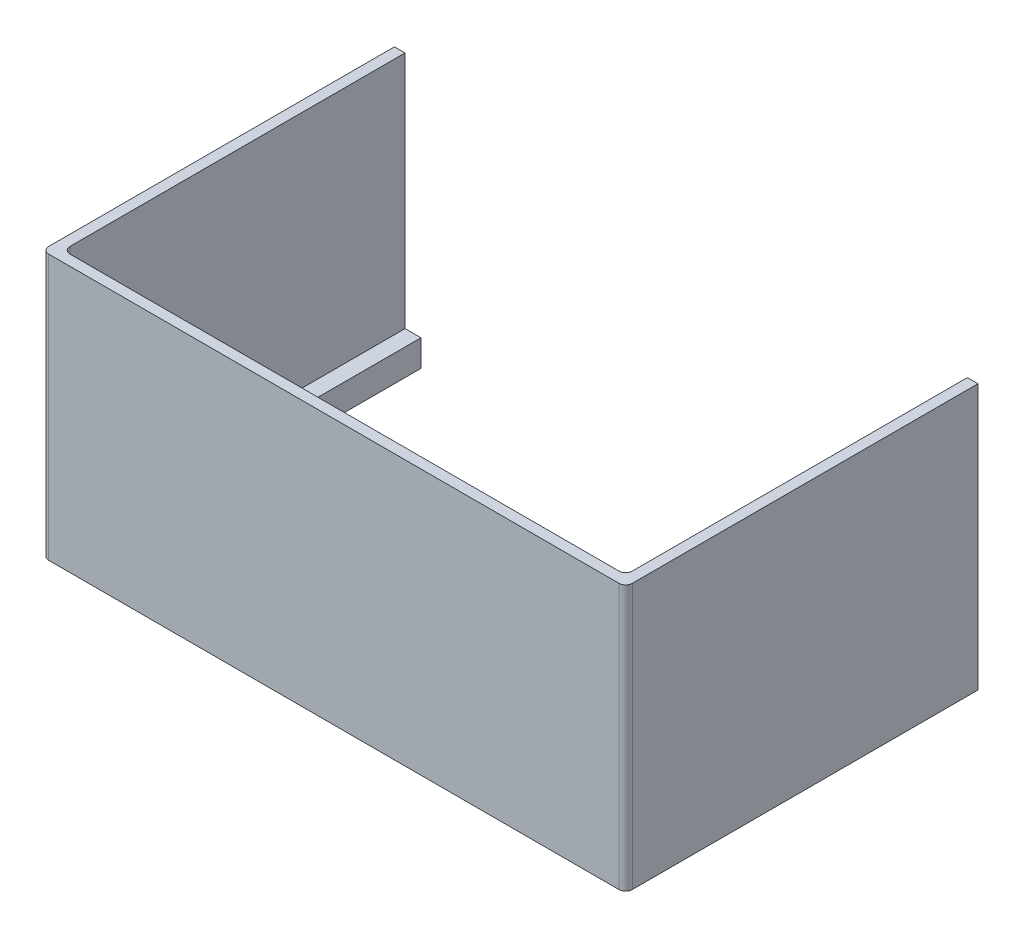
ISO-10303-21;
HEADER;
FILE_DESCRIPTION(('STEP AP214'),'2;1');
FILE_NAME('part.step','',(''),(''),'','','');
FILE_SCHEMA(('AUTOMOTIVE_DESIGN { 1 0 10303 214 1 1 1 1 }'));
ENDSEC;
DATA;
#1=APPLICATION_CONTEXT('core data for automotive mechanical design processes');
#2=APPLICATION_PROTOCOL_DEFINITION('international standard','automotive_design',2000,#1);
#3=PRODUCT_CONTEXT('',#1,'mechanical');
#4=PRODUCT('Part','Part','',(#3));
#5=PRODUCT_RELATED_PRODUCT_CATEGORY('part','',(#4));
#6=PRODUCT_DEFINITION_FORMATION('','',#4);
#7=PRODUCT_DEFINITION_CONTEXT('part definition',#1,'design');
#8=PRODUCT_DEFINITION('design','',#6,#7);
#9=PRODUCT_DEFINITION_SHAPE('','',#8);
#10=(LENGTH_UNIT() NAMED_UNIT(*) SI_UNIT(.MILLI.,.METRE.));
#11=(NAMED_UNIT(*) PLANE_ANGLE_UNIT() SI_UNIT($,.RADIAN.));
#12=(NAMED_UNIT(*) SI_UNIT($,.STERADIAN.) SOLID_ANGLE_UNIT());
#13=UNCERTAINTY_MEASURE_WITH_UNIT(LENGTH_MEASURE(1.E-05),#10,'distance_accuracy_value','');
#14=(GEOMETRIC_REPRESENTATION_CONTEXT(3) GLOBAL_UNCERTAINTY_ASSIGNED_CONTEXT((#13)) GLOBAL_UNIT_ASSIGNED_CONTEXT((#10,
#11,#12)) REPRESENTATION_CONTEXT('',''));
#15=CARTESIAN_POINT('',(0.,0.,0.));
#16=DIRECTION('',(0.,0.,1.));
#17=DIRECTION('',(1.,0.,0.));
#18=AXIS2_PLACEMENT_3D('',#15,#16,#17);
#19=CARTESIAN_POINT('',(-69.85,0.,-7.25424000000001));
#20=DIRECTION('',(0.,0.,1.));
#21=DIRECTION('',(1.,0.,0.));
#22=AXIS2_PLACEMENT_3D('',#19,#20,#21);
#23=PLANE('',#22);
#24=DIRECTION('',(1.,0.,0.));
#25=VECTOR('',#24,1.);
#26=CARTESIAN_POINT('',(-69.85,0.,-7.25424000000001));
#27=LINE('',#26,#25);
#28=CARTESIAN_POINT('',(-69.85,0.,-7.25424000000001));
#29=VERTEX_POINT('',#28);
#30=CARTESIAN_POINT('',(-63.5000000000001,0.,-7.25424000000001));
#31=VERTEX_POINT('',#30);
#32=EDGE_CURVE('E268',#29,#31,#27,.T.);
#33=ORIENTED_EDGE('',*,*,#32,.F.);
#34=DIRECTION('',(0.,1.,0.));
#35=VECTOR('',#34,1.);
#36=CARTESIAN_POINT('',(-69.85,0.,-7.25424000000001));
#37=LINE('',#36,#35);
#38=CARTESIAN_POINT('',(-69.85,63.5,-7.25424000000001));
#39=VERTEX_POINT('',#38);
#40=EDGE_CURVE('E271',#29,#39,#37,.T.);
#41=ORIENTED_EDGE('',*,*,#40,.T.);
#42=DIRECTION('',(1.,0.,0.));
#43=VECTOR('',#42,1.);
#44=CARTESIAN_POINT('',(-69.85,63.5,-7.25424000000001));
#45=LINE('',#44,#43);
#46=CARTESIAN_POINT('',(-67.31,63.5,-7.25424000000001));
#47=VERTEX_POINT('',#46);
#48=EDGE_CURVE('E273',#39,#47,#45,.T.);
#49=ORIENTED_EDGE('',*,*,#48,.T.);
#50=DIRECTION('',(0.,-1.,0.));
#51=VECTOR('',#50,1.);
#52=CARTESIAN_POINT('',(-67.31,63.5,-7.25424000000001));
#53=LINE('',#52,#51);
#54=CARTESIAN_POINT('',(-67.31,6.35,-7.25424000000001));
#55=VERTEX_POINT('',#54);
#56=EDGE_CURVE('E343',#47,#55,#53,.T.);
#57=ORIENTED_EDGE('',*,*,#56,.T.);
#58=DIRECTION('',(-1.,0.,0.));
#59=VECTOR('',#58,1.);
#60=CARTESIAN_POINT('',(0.,6.35,-7.25424000000001));
#61=LINE('',#60,#59);
#62=CARTESIAN_POINT('',(-63.5000000000001,6.35,-7.25424000000001));
#63=VERTEX_POINT('',#62);
#64=EDGE_CURVE('E278',#63,#55,#61,.T.);
#65=ORIENTED_EDGE('',*,*,#64,.F.);
#66=DIRECTION('',(0.,1.,0.));
#67=VECTOR('',#66,1.);
#68=CARTESIAN_POINT('',(-63.5000000000001,0.,-7.25424000000001));
#69=LINE('',#68,#67);
#70=EDGE_CURVE('E282',#31,#63,#69,.T.);
#71=ORIENTED_EDGE('',*,*,#70,.F.);
#72=EDGE_LOOP('',(#33,#41,#49,#57,#65,#71));
#73=FACE_BOUND('',#72,.T.);
#74=DIRECTION('',(0.,-1.,0.));
#75=VECTOR('',#74,1.);
#76=CARTESIAN_POINT('',(-67.437,0.,-7.25424000000001));
#77=LINE('',#76,#75);
#78=CARTESIAN_POINT('',(-67.437,4.8895,-7.25424000000001));
#79=VERTEX_POINT('',#78);
#80=CARTESIAN_POINT('',(-67.437,1.4605,-7.25424000000001));
#81=VERTEX_POINT('',#80);
#82=EDGE_CURVE('E221',#79,#81,#77,.T.);
#83=ORIENTED_EDGE('',*,*,#82,.T.);
#84=DIRECTION('',(1.,0.,0.));
#85=VECTOR('',#84,1.);
#86=CARTESIAN_POINT('',(0.,1.4605,-7.25424000000001));
#87=LINE('',#86,#85);
#88=CARTESIAN_POINT('',(-64.9605000000001,1.4605,-7.25424000000001));
#89=VERTEX_POINT('',#88);
#90=EDGE_CURVE('E242',#81,#89,#87,.T.);
#91=ORIENTED_EDGE('',*,*,#90,.T.);
#92=DIRECTION('',(0.,-1.,0.));
#93=VECTOR('',#92,1.);
#94=CARTESIAN_POINT('',(-64.9605000000001,0.,-7.25424000000001));
#95=LINE('',#94,#93);
#96=CARTESIAN_POINT('',(-64.9605000000001,4.8895,-7.25424000000001));
#97=VERTEX_POINT('',#96);
#98=EDGE_CURVE('E253',#97,#89,#95,.T.);
#99=ORIENTED_EDGE('',*,*,#98,.F.);
#100=DIRECTION('',(1.,0.,0.));
#101=VECTOR('',#100,1.);
#102=CARTESIAN_POINT('',(0.,4.8895,-7.25424000000001));
#103=LINE('',#102,#101);
#104=EDGE_CURVE('E224',#79,#97,#103,.T.);
#105=ORIENTED_EDGE('',*,*,#104,.F.);
#106=EDGE_LOOP('',(#83,#91,#99,#105));
#107=FACE_BOUND('',#106,.T.);
#108=ADVANCED_FACE('F34',(#73,#107),#23,.F.);
#109=CARTESIAN_POINT('',(69.85,6.35,77.10424));
#110=DIRECTION('',(-1.,0.,0.));
#111=DIRECTION('',(0.,0.,1.));
#112=AXIS2_PLACEMENT_3D('',#109,#110,#111);
#113=PLANE('',#112);
#114=DIRECTION('',(0.,0.,-1.));
#115=VECTOR('',#114,1.);
#116=CARTESIAN_POINT('',(69.85,63.5,-77.10424));
#117=LINE('',#116,#115);
#118=CARTESIAN_POINT('',(69.85,63.5,75.51674));
#119=VERTEX_POINT('',#118);
#120=CARTESIAN_POINT('',(69.85,63.5,-7.25424000000001));
#121=VERTEX_POINT('',#120);
#122=EDGE_CURVE('E302',#119,#121,#117,.T.);
#123=ORIENTED_EDGE('',*,*,#122,.F.);
#124=DIRECTION('',(0.,-1.,0.));
#125=VECTOR('',#124,1.);
#126=CARTESIAN_POINT('',(69.85,6.35,75.51674));
#127=LINE('',#126,#125);
#128=CARTESIAN_POINT('',(69.85,0.,75.51674));
#129=VERTEX_POINT('',#128);
#130=EDGE_CURVE('E345',#119,#129,#127,.T.);
#131=ORIENTED_EDGE('',*,*,#130,.T.);
#132=DIRECTION('',(0.,0.,-1.));
#133=VECTOR('',#132,1.);
#134=CARTESIAN_POINT('',(69.85,0.,77.10424));
#135=LINE('',#134,#133);
#136=CARTESIAN_POINT('',(69.85,0.,-7.25424000000001));
#137=VERTEX_POINT('',#136);
#138=EDGE_CURVE('E333',#129,#137,#135,.T.);
#139=ORIENTED_EDGE('',*,*,#138,.T.);
#140=DIRECTION('',(0.,1.,0.));
#141=VECTOR('',#140,1.);
#142=CARTESIAN_POINT('',(69.85,0.,-7.25424000000001));
#143=LINE('',#142,#141);
#144=EDGE_CURVE('E275',#137,#121,#143,.T.);
#145=ORIENTED_EDGE('',*,*,#144,.T.);
#146=EDGE_LOOP('',(#123,#131,#139,#145));
#147=FACE_BOUND('',#146,.T.);
#148=ADVANCED_FACE('F440',(#147),#113,.F.);
#149=CARTESIAN_POINT('',(-69.85,6.35,77.10424));
#150=DIRECTION('',(1.,0.,0.));
#151=DIRECTION('',(0.,0.,-1.));
#152=AXIS2_PLACEMENT_3D('',#149,#150,#151);
#153=PLANE('',#152);
#154=DIRECTION('',(0.,0.,1.));
#155=VECTOR('',#154,1.);
#156=CARTESIAN_POINT('',(-69.85,0.,77.10424));
#157=LINE('',#156,#155);
#158=CARTESIAN_POINT('',(-69.85,0.,75.51674));
#159=VERTEX_POINT('',#158);
#160=EDGE_CURVE('E337',#29,#159,#157,.T.);
#161=ORIENTED_EDGE('',*,*,#160,.T.);
#162=DIRECTION('',(0.,-1.,0.));
#163=VECTOR('',#162,1.);
#164=CARTESIAN_POINT('',(-69.85,6.35,75.51674));
#165=LINE('',#164,#163);
#166=CARTESIAN_POINT('',(-69.85,63.5,75.51674));
#167=VERTEX_POINT('',#166);
#168=EDGE_CURVE('E361',#159,#167,#165,.F.);
#169=ORIENTED_EDGE('',*,*,#168,.T.);
#170=DIRECTION('',(0.,0.,1.));
#171=VECTOR('',#170,1.);
#172=CARTESIAN_POINT('',(-69.85,63.5,-77.10424));
#173=LINE('',#172,#171);
#174=EDGE_CURVE('E308',#39,#167,#173,.T.);
#175=ORIENTED_EDGE('',*,*,#174,.F.);
#176=ORIENTED_EDGE('',*,*,#40,.F.);
#177=EDGE_LOOP('',(#161,#169,#175,#176));
#178=FACE_BOUND('',#177,.T.);
#179=ADVANCED_FACE('F424',(#178),#153,.F.);
#180=CARTESIAN_POINT('',(-69.85,6.35,77.10424));
#181=DIRECTION('',(0.,0.,-1.));
#182=DIRECTION('',(-1.,0.,0.));
#183=AXIS2_PLACEMENT_3D('',#180,#181,#182);
#184=PLANE('',#183);
#185=DIRECTION('',(1.,0.,0.));
#186=VECTOR('',#185,1.);
#187=CARTESIAN_POINT('',(-69.85,0.,77.10424));
#188=LINE('',#187,#186);
#189=CARTESIAN_POINT('',(-68.2624999999999,0.,77.10424));
#190=VERTEX_POINT('',#189);
#191=CARTESIAN_POINT('',(68.2625,0.,77.10424));
#192=VERTEX_POINT('',#191);
#193=EDGE_CURVE('E340',#190,#192,#188,.T.);
#194=ORIENTED_EDGE('',*,*,#193,.T.);
#195=DIRECTION('',(0.,-1.,0.));
#196=VECTOR('',#195,1.);
#197=CARTESIAN_POINT('',(68.2625,6.35,77.10424));
#198=LINE('',#197,#196);
#199=CARTESIAN_POINT('',(68.2625,63.5,77.10424));
#200=VERTEX_POINT('',#199);
#201=EDGE_CURVE('E355',#192,#200,#198,.F.);
#202=ORIENTED_EDGE('',*,*,#201,.T.);
#203=DIRECTION('',(1.,0.,0.));
#204=VECTOR('',#203,1.);
#205=CARTESIAN_POINT('',(-69.85,63.5,77.10424));
#206=LINE('',#205,#204);
#207=CARTESIAN_POINT('',(-68.2624999999999,63.5,77.10424));
#208=VERTEX_POINT('',#207);
#209=EDGE_CURVE('E311',#208,#200,#206,.T.);
#210=ORIENTED_EDGE('',*,*,#209,.F.);
#211=DIRECTION('',(0.,-1.,0.));
#212=VECTOR('',#211,1.);
#213=CARTESIAN_POINT('',(-68.2624999999999,6.35,77.10424));
#214=LINE('',#213,#212);
#215=EDGE_CURVE('E352',#208,#190,#214,.T.);
#216=ORIENTED_EDGE('',*,*,#215,.T.);
#217=EDGE_LOOP('',(#194,#202,#210,#216));
#218=FACE_BOUND('',#217,.T.);
#219=ADVANCED_FACE('F433',(#218),#184,.F.);
#220=CARTESIAN_POINT('',(0.,6.35,0.));
#221=DIRECTION('',(0.,-1.,0.));
#222=DIRECTION('',(0.,0.,-1.));
#223=AXIS2_PLACEMENT_3D('',#220,#221,#222);
#224=PLANE('',#223);
#225=DIRECTION('',(0.,0.,1.));
#226=VECTOR('',#225,1.);
#227=CARTESIAN_POINT('',(-67.31,6.35,-74.56424));
#228=LINE('',#227,#226);
#229=CARTESIAN_POINT('',(-67.31,6.35,72.97674));
#230=VERTEX_POINT('',#229);
#231=EDGE_CURVE('E304',#55,#230,#228,.T.);
#232=ORIENTED_EDGE('',*,*,#231,.T.);
#233=CARTESIAN_POINT('',(-65.7225,6.35,72.97674));
#234=DIRECTION('',(0.,-1.,0.));
#235=DIRECTION('',(0.,0.,-1.));
#236=AXIS2_PLACEMENT_3D('',#233,#234,#235);
#237=CIRCLE('',#236,1.5875);
#238=CARTESIAN_POINT('',(-65.7225,6.35,74.56424));
#239=VERTEX_POINT('',#238);
#240=EDGE_CURVE('E57',#230,#239,#237,.F.);
#241=ORIENTED_EDGE('',*,*,#240,.T.);
#242=DIRECTION('',(1.,0.,0.));
#243=VECTOR('',#242,1.);
#244=CARTESIAN_POINT('',(-67.31,6.35,74.56424));
#245=LINE('',#244,#243);
#246=CARTESIAN_POINT('',(65.7225,6.35,74.56424));
#247=VERTEX_POINT('',#246);
#248=EDGE_CURVE('E296',#239,#247,#245,.T.);
#249=ORIENTED_EDGE('',*,*,#248,.T.);
#250=CARTESIAN_POINT('',(65.7225,6.35,72.97674));
#251=DIRECTION('',(0.,-1.,0.));
#252=DIRECTION('',(0.,0.,-1.));
#253=AXIS2_PLACEMENT_3D('',#250,#251,#252);
#254=CIRCLE('',#253,1.5875);
#255=CARTESIAN_POINT('',(67.31,6.35,72.97674));
#256=VERTEX_POINT('',#255);
#257=EDGE_CURVE('E49',#247,#256,#254,.F.);
#258=ORIENTED_EDGE('',*,*,#257,.T.);
#259=DIRECTION('',(0.,0.,-1.));
#260=VECTOR('',#259,1.);
#261=CARTESIAN_POINT('',(67.31,6.35,-74.56424));
#262=LINE('',#261,#260);
#263=CARTESIAN_POINT('',(67.31,6.35,-7.25424000000001));
#264=VERTEX_POINT('',#263);
#265=EDGE_CURVE('E292',#256,#264,#262,.T.);
#266=ORIENTED_EDGE('',*,*,#265,.T.);
#267=CARTESIAN_POINT('',(63.5,6.35,-7.25424000000001));
#268=VERTEX_POINT('',#267);
#269=EDGE_CURVE('E283',#264,#268,#61,.T.);
#270=ORIENTED_EDGE('',*,*,#269,.T.);
#271=DIRECTION('',(0.,0.,-1.));
#272=VECTOR('',#271,1.);
#273=CARTESIAN_POINT('',(63.5,6.35,70.75424));
#274=LINE('',#273,#272);
#275=CARTESIAN_POINT('',(63.5,6.35,70.75424));
#276=VERTEX_POINT('',#275);
#277=EDGE_CURVE('E314',#276,#268,#274,.T.);
#278=ORIENTED_EDGE('',*,*,#277,.F.);
#279=DIRECTION('',(1.,0.,0.));
#280=VECTOR('',#279,1.);
#281=CARTESIAN_POINT('',(-63.5000000000001,6.35,70.75424));
#282=LINE('',#281,#280);
#283=CARTESIAN_POINT('',(-63.5000000000001,6.35,70.75424));
#284=VERTEX_POINT('',#283);
#285=EDGE_CURVE('E319',#284,#276,#282,.T.);
#286=ORIENTED_EDGE('',*,*,#285,.F.);
#287=DIRECTION('',(0.,0.,1.));
#288=VECTOR('',#287,1.);
#289=CARTESIAN_POINT('',(-63.5000000000001,6.35,70.75424));
#290=LINE('',#289,#288);
#291=EDGE_CURVE('E327',#63,#284,#290,.T.);
#292=ORIENTED_EDGE('',*,*,#291,.F.);
#293=ORIENTED_EDGE('',*,*,#64,.T.);
#294=EDGE_LOOP('',(#232,#241,#249,#258,#266,#270,#278,#286,#292,#293));
#295=FACE_BOUND('',#294,.T.);
#296=ADVANCED_FACE('F389',(#295),#224,.F.);
#297=CARTESIAN_POINT('',(0.,0.,0.));
#298=DIRECTION('',(0.,-1.,0.));
#299=DIRECTION('',(0.,0.,-1.));
#300=AXIS2_PLACEMENT_3D('',#297,#298,#299);
#301=PLANE('',#300);
#302=ORIENTED_EDGE('',*,*,#138,.F.);
#303=CARTESIAN_POINT('',(68.2625,0.,75.51674));
#304=DIRECTION('',(0.,-1.,0.));
#305=DIRECTION('',(0.,0.,-1.));
#306=AXIS2_PLACEMENT_3D('',#303,#304,#305);
#307=CIRCLE('',#306,1.5875);
#308=EDGE_CURVE('E350',#129,#192,#307,.T.);
#309=ORIENTED_EDGE('',*,*,#308,.T.);
#310=ORIENTED_EDGE('',*,*,#193,.F.);
#311=CARTESIAN_POINT('',(-68.2624999999999,0.,75.51674));
#312=DIRECTION('',(0.,-1.,0.));
#313=DIRECTION('',(0.,0.,-1.));
#314=AXIS2_PLACEMENT_3D('',#311,#312,#313);
#315=CIRCLE('',#314,1.5875);
#316=EDGE_CURVE('E348',#190,#159,#315,.T.);
#317=ORIENTED_EDGE('',*,*,#316,.T.);
#318=ORIENTED_EDGE('',*,*,#160,.F.);
#319=ORIENTED_EDGE('',*,*,#32,.T.);
#320=DIRECTION('',(0.,0.,1.));
#321=VECTOR('',#320,1.);
#322=CARTESIAN_POINT('',(-63.5000000000001,0.,70.75424));
#323=LINE('',#322,#321);
#324=CARTESIAN_POINT('',(-63.5000000000001,0.,70.75424));
#325=VERTEX_POINT('',#324);
#326=EDGE_CURVE('E318',#31,#325,#323,.T.);
#327=ORIENTED_EDGE('',*,*,#326,.T.);
#328=DIRECTION('',(1.,0.,0.));
#329=VECTOR('',#328,1.);
#330=CARTESIAN_POINT('',(-63.5000000000001,0.,70.75424));
#331=LINE('',#330,#329);
#332=CARTESIAN_POINT('',(63.5,0.,70.75424));
#333=VERTEX_POINT('',#332);
#334=EDGE_CURVE('E321',#325,#333,#331,.T.);
#335=ORIENTED_EDGE('',*,*,#334,.T.);
#336=DIRECTION('',(0.,0.,-1.));
#337=VECTOR('',#336,1.);
#338=CARTESIAN_POINT('',(63.5,0.,70.75424));
#339=LINE('',#338,#337);
#340=CARTESIAN_POINT('',(63.5,0.,-7.25424000000001));
#341=VERTEX_POINT('',#340);
#342=EDGE_CURVE('E315',#333,#341,#339,.T.);
#343=ORIENTED_EDGE('',*,*,#342,.T.);
#344=EDGE_CURVE('E272',#341,#137,#27,.T.);
#345=ORIENTED_EDGE('',*,*,#344,.T.);
#346=EDGE_LOOP('',(#302,#309,#310,#317,#318,#319,#327,#335,#343,#345));
#347=FACE_BOUND('',#346,.T.);
#348=ADVANCED_FACE('F420',(#347),#301,.T.);
#349=CARTESIAN_POINT('',(63.5,0.,70.75424));
#350=DIRECTION('',(1.,0.,0.));
#351=DIRECTION('',(0.,0.,-1.));
#352=AXIS2_PLACEMENT_3D('',#349,#350,#351);
#353=PLANE('',#352);
#354=ORIENTED_EDGE('',*,*,#277,.T.);
#355=DIRECTION('',(0.,-1.,0.));
#356=VECTOR('',#355,1.);
#357=CARTESIAN_POINT('',(63.5,0.,-7.25424000000001));
#358=LINE('',#357,#356);
#359=EDGE_CURVE('E289',#268,#341,#358,.T.);
#360=ORIENTED_EDGE('',*,*,#359,.T.);
#361=ORIENTED_EDGE('',*,*,#342,.F.);
#362=DIRECTION('',(0.,1.,0.));
#363=VECTOR('',#362,1.);
#364=CARTESIAN_POINT('',(63.5,0.,70.75424));
#365=LINE('',#364,#363);
#366=EDGE_CURVE('E331',#333,#276,#365,.T.);
#367=ORIENTED_EDGE('',*,*,#366,.T.);
#368=EDGE_LOOP('',(#354,#360,#361,#367));
#369=FACE_BOUND('',#368,.T.);
#370=ADVANCED_FACE('F404',(#369),#353,.F.);
#371=CARTESIAN_POINT('',(-63.5000000000001,0.,70.75424));
#372=DIRECTION('',(0.,0.,1.));
#373=DIRECTION('',(1.,0.,0.));
#374=AXIS2_PLACEMENT_3D('',#371,#372,#373);
#375=PLANE('',#374);
#376=ORIENTED_EDGE('',*,*,#285,.T.);
#377=ORIENTED_EDGE('',*,*,#366,.F.);
#378=ORIENTED_EDGE('',*,*,#334,.F.);
#379=DIRECTION('',(0.,1.,0.));
#380=VECTOR('',#379,1.);
#381=CARTESIAN_POINT('',(-63.5000000000001,0.,70.75424));
#382=LINE('',#381,#380);
#383=EDGE_CURVE('E324',#325,#284,#382,.T.);
#384=ORIENTED_EDGE('',*,*,#383,.T.);
#385=EDGE_LOOP('',(#376,#377,#378,#384));
#386=FACE_BOUND('',#385,.T.);
#387=ADVANCED_FACE('F408',(#386),#375,.F.);
#388=CARTESIAN_POINT('',(-63.5000000000001,0.,70.75424));
#389=DIRECTION('',(-1.,0.,0.));
#390=DIRECTION('',(0.,0.,1.));
#391=AXIS2_PLACEMENT_3D('',#388,#389,#390);
#392=PLANE('',#391);
#393=ORIENTED_EDGE('',*,*,#326,.F.);
#394=ORIENTED_EDGE('',*,*,#70,.T.);
#395=ORIENTED_EDGE('',*,*,#291,.T.);
#396=ORIENTED_EDGE('',*,*,#383,.F.);
#397=EDGE_LOOP('',(#393,#394,#395,#396));
#398=FACE_BOUND('',#397,.T.);
#399=ADVANCED_FACE('F413',(#398),#392,.F.);
#400=CARTESIAN_POINT('',(0.,63.5,0.));
#401=DIRECTION('',(0.,1.,0.));
#402=DIRECTION('',(0.,0.,1.));
#403=AXIS2_PLACEMENT_3D('',#400,#401,#402);
#404=PLANE('',#403);
#405=ORIENTED_EDGE('',*,*,#209,.T.);
#406=CARTESIAN_POINT('',(68.2625,63.5,75.51674));
#407=DIRECTION('',(0.,1.,0.));
#408=DIRECTION('',(0.,0.,1.));
#409=AXIS2_PLACEMENT_3D('',#406,#407,#408);
#410=CIRCLE('',#409,1.5875);
#411=EDGE_CURVE('E359',#200,#119,#410,.T.);
#412=ORIENTED_EDGE('',*,*,#411,.T.);
#413=ORIENTED_EDGE('',*,*,#122,.T.);
#414=CARTESIAN_POINT('',(67.31,63.5,-7.25424000000001));
#415=VERTEX_POINT('',#414);
#416=EDGE_CURVE('E261',#415,#121,#45,.T.);
#417=ORIENTED_EDGE('',*,*,#416,.F.);
#418=DIRECTION('',(0.,0.,-1.));
#419=VECTOR('',#418,1.);
#420=CARTESIAN_POINT('',(67.31,63.5,-74.56424));
#421=LINE('',#420,#419);
#422=CARTESIAN_POINT('',(67.31,63.5,72.97674));
#423=VERTEX_POINT('',#422);
#424=EDGE_CURVE('E293',#423,#415,#421,.T.);
#425=ORIENTED_EDGE('',*,*,#424,.F.);
#426=CARTESIAN_POINT('',(65.7225,63.5,72.97674));
#427=DIRECTION('',(0.,1.,0.));
#428=DIRECTION('',(0.,0.,1.));
#429=AXIS2_PLACEMENT_3D('',#426,#427,#428);
#430=CIRCLE('',#429,1.5875);
#431=CARTESIAN_POINT('',(65.7225,63.5,74.56424));
#432=VERTEX_POINT('',#431);
#433=EDGE_CURVE('E11',#423,#432,#430,.F.);
#434=ORIENTED_EDGE('',*,*,#433,.T.);
#435=DIRECTION('',(1.,0.,0.));
#436=VECTOR('',#435,1.);
#437=CARTESIAN_POINT('',(-67.31,63.5,74.56424));
#438=LINE('',#437,#436);
#439=CARTESIAN_POINT('',(-65.7225,63.5,74.56424));
#440=VERTEX_POINT('',#439);
#441=EDGE_CURVE('E299',#440,#432,#438,.T.);
#442=ORIENTED_EDGE('',*,*,#441,.F.);
#443=CARTESIAN_POINT('',(-65.7225,63.5,72.97674));
#444=DIRECTION('',(0.,1.,0.));
#445=DIRECTION('',(0.,0.,1.));
#446=AXIS2_PLACEMENT_3D('',#443,#444,#445);
#447=CIRCLE('',#446,1.5875);
#448=CARTESIAN_POINT('',(-67.31,63.5,72.97674));
#449=VERTEX_POINT('',#448);
#450=EDGE_CURVE('E42',#440,#449,#447,.F.);
#451=ORIENTED_EDGE('',*,*,#450,.T.);
#452=DIRECTION('',(0.,0.,1.));
#453=VECTOR('',#452,1.);
#454=CARTESIAN_POINT('',(-67.31,63.5,-74.56424));
#455=LINE('',#454,#453);
#456=EDGE_CURVE('E295',#47,#449,#455,.T.);
#457=ORIENTED_EDGE('',*,*,#456,.F.);
#458=ORIENTED_EDGE('',*,*,#48,.F.);
#459=ORIENTED_EDGE('',*,*,#174,.T.);
#460=CARTESIAN_POINT('',(-68.2624999999999,63.5,75.51674));
#461=DIRECTION('',(0.,1.,0.));
#462=DIRECTION('',(0.,0.,1.));
#463=AXIS2_PLACEMENT_3D('',#460,#461,#462);
#464=CIRCLE('',#463,1.5875);
#465=EDGE_CURVE('E357',#167,#208,#464,.T.);
#466=ORIENTED_EDGE('',*,*,#465,.T.);
#467=EDGE_LOOP('',(#405,#412,#413,#417,#425,#434,#442,#451,#457,#458,#459,#466));
#468=FACE_BOUND('',#467,.T.);
#469=ADVANCED_FACE('F377',(#468),#404,.T.);
#470=CARTESIAN_POINT('',(67.31,63.5,-74.56424));
#471=DIRECTION('',(-1.,0.,0.));
#472=DIRECTION('',(0.,0.,1.));
#473=AXIS2_PLACEMENT_3D('',#470,#471,#472);
#474=PLANE('',#473);
#475=ORIENTED_EDGE('',*,*,#265,.F.);
#476=DIRECTION('',(0.,-1.,0.));
#477=VECTOR('',#476,1.);
#478=CARTESIAN_POINT('',(67.31,63.5,72.97674));
#479=LINE('',#478,#477);
#480=EDGE_CURVE('E372',#256,#423,#479,.F.);
#481=ORIENTED_EDGE('',*,*,#480,.T.);
#482=ORIENTED_EDGE('',*,*,#424,.T.);
#483=DIRECTION('',(0.,1.,0.));
#484=VECTOR('',#483,1.);
#485=CARTESIAN_POINT('',(67.31,63.5,-7.25424000000001));
#486=LINE('',#485,#484);
#487=EDGE_CURVE('E286',#264,#415,#486,.T.);
#488=ORIENTED_EDGE('',*,*,#487,.F.);
#489=EDGE_LOOP('',(#475,#481,#482,#488));
#490=FACE_BOUND('',#489,.T.);
#491=ADVANCED_FACE('F395',(#490),#474,.T.);
#492=CARTESIAN_POINT('',(-67.31,63.5,-74.56424));
#493=DIRECTION('',(1.,0.,0.));
#494=DIRECTION('',(0.,0.,-1.));
#495=AXIS2_PLACEMENT_3D('',#492,#493,#494);
#496=PLANE('',#495);
#497=ORIENTED_EDGE('',*,*,#456,.T.);
#498=DIRECTION('',(0.,-1.,0.));
#499=VECTOR('',#498,1.);
#500=CARTESIAN_POINT('',(-67.31,6.35,72.97674));
#501=LINE('',#500,#499);
#502=EDGE_CURVE('E363',#449,#230,#501,.T.);
#503=ORIENTED_EDGE('',*,*,#502,.T.);
#504=ORIENTED_EDGE('',*,*,#231,.F.);
#505=ORIENTED_EDGE('',*,*,#56,.F.);
#506=EDGE_LOOP('',(#497,#503,#504,#505));
#507=FACE_BOUND('',#506,.T.);
#508=ADVANCED_FACE('F384',(#507),#496,.T.);
#509=CARTESIAN_POINT('',(-67.31,63.5,74.56424));
#510=DIRECTION('',(0.,0.,-1.));
#511=DIRECTION('',(-1.,0.,0.));
#512=AXIS2_PLACEMENT_3D('',#509,#510,#511);
#513=PLANE('',#512);
#514=ORIENTED_EDGE('',*,*,#248,.F.);
#515=DIRECTION('',(0.,-1.,0.));
#516=VECTOR('',#515,1.);
#517=CARTESIAN_POINT('',(-65.7225,63.5,74.56424));
#518=LINE('',#517,#516);
#519=EDGE_CURVE('E370',#239,#440,#518,.F.);
#520=ORIENTED_EDGE('',*,*,#519,.T.);
#521=ORIENTED_EDGE('',*,*,#441,.T.);
#522=DIRECTION('',(0.,-1.,0.));
#523=VECTOR('',#522,1.);
#524=CARTESIAN_POINT('',(65.7225,6.35,74.56424));
#525=LINE('',#524,#523);
#526=EDGE_CURVE('E368',#432,#247,#525,.T.);
#527=ORIENTED_EDGE('',*,*,#526,.T.);
#528=EDGE_LOOP('',(#514,#520,#521,#527));
#529=FACE_BOUND('',#528,.T.);
#530=ADVANCED_FACE('F388',(#529),#513,.T.);
#531=DIRECTION('',(-1.,0.,0.));
#532=VECTOR('',#531,1.);
#533=CARTESIAN_POINT('',(67.437,1.4605,-7.25424000000001));
#534=LINE('',#533,#532);
#535=CARTESIAN_POINT('',(67.4370000000001,1.4605,-7.25424000000001));
#536=VERTEX_POINT('',#535);
#537=CARTESIAN_POINT('',(64.9605000000001,1.4605,-7.25424000000001));
#538=VERTEX_POINT('',#537);
#539=EDGE_CURVE('E220',#536,#538,#534,.T.);
#540=ORIENTED_EDGE('',*,*,#539,.F.);
#541=DIRECTION('',(0.,-1.,0.));
#542=VECTOR('',#541,1.);
#543=CARTESIAN_POINT('',(67.437,4.8895,-7.25424000000001));
#544=LINE('',#543,#542);
#545=CARTESIAN_POINT('',(67.437,4.8895,-7.25424000000001));
#546=VERTEX_POINT('',#545);
#547=EDGE_CURVE('E199',#546,#536,#544,.T.);
#548=ORIENTED_EDGE('',*,*,#547,.F.);
#549=DIRECTION('',(-1.,0.,0.));
#550=VECTOR('',#549,1.);
#551=CARTESIAN_POINT('',(67.437,4.8895,-7.25424000000001));
#552=LINE('',#551,#550);
#553=CARTESIAN_POINT('',(64.9605000000001,4.8895,-7.25424000000001));
#554=VERTEX_POINT('',#553);
#555=EDGE_CURVE('E208',#546,#554,#552,.T.);
#556=ORIENTED_EDGE('',*,*,#555,.T.);
#557=DIRECTION('',(0.,-1.,0.));
#558=VECTOR('',#557,1.);
#559=CARTESIAN_POINT('',(64.9605000000001,4.8895,-7.25424000000001));
#560=LINE('',#559,#558);
#561=EDGE_CURVE('E214',#554,#538,#560,.T.);
#562=ORIENTED_EDGE('',*,*,#561,.T.);
#563=EDGE_LOOP('',(#540,#548,#556,#562));
#564=FACE_BOUND('',#563,.T.);
#565=ORIENTED_EDGE('',*,*,#269,.F.);
#566=ORIENTED_EDGE('',*,*,#487,.T.);
#567=ORIENTED_EDGE('',*,*,#416,.T.);
#568=ORIENTED_EDGE('',*,*,#144,.F.);
#569=ORIENTED_EDGE('',*,*,#344,.F.);
#570=ORIENTED_EDGE('',*,*,#359,.F.);
#571=EDGE_LOOP('',(#565,#566,#567,#568,#569,#570));
#572=FACE_BOUND('',#571,.T.);
#573=ADVANCED_FACE('F217',(#564,#572),#23,.F.);
#574=CARTESIAN_POINT('',(-67.437,0.,-3.44424000000001));
#575=DIRECTION('',(1.,0.,0.));
#576=DIRECTION('',(0.,0.,-1.));
#577=AXIS2_PLACEMENT_3D('',#574,#575,#576);
#578=PLANE('',#577);
#579=ORIENTED_EDGE('',*,*,#82,.F.);
#580=DIRECTION('',(0.,0.,-1.));
#581=VECTOR('',#580,1.);
#582=CARTESIAN_POINT('',(-67.437,4.8895,-3.44424000000001));
#583=LINE('',#582,#581);
#584=CARTESIAN_POINT('',(-67.437,4.8895,-3.44424000000001));
#585=VERTEX_POINT('',#584);
#586=EDGE_CURVE('E249',#585,#79,#583,.T.);
#587=ORIENTED_EDGE('',*,*,#586,.F.);
#588=DIRECTION('',(0.,-1.,0.));
#589=VECTOR('',#588,1.);
#590=CARTESIAN_POINT('',(-67.437,0.,-3.44424000000001));
#591=LINE('',#590,#589);
#592=CARTESIAN_POINT('',(-67.437,1.4605,-3.44424000000001));
#593=VERTEX_POINT('',#592);
#594=EDGE_CURVE('E238',#585,#593,#591,.T.);
#595=ORIENTED_EDGE('',*,*,#594,.T.);
#596=DIRECTION('',(0.,0.,-1.));
#597=VECTOR('',#596,1.);
#598=CARTESIAN_POINT('',(-67.437,1.4605,-3.44424000000001));
#599=LINE('',#598,#597);
#600=EDGE_CURVE('E258',#593,#81,#599,.T.);
#601=ORIENTED_EDGE('',*,*,#600,.T.);
#602=EDGE_LOOP('',(#579,#587,#595,#601));
#603=FACE_BOUND('',#602,.T.);
#604=ADVANCED_FACE('F556',(#603),#578,.T.);
#605=CARTESIAN_POINT('',(0.,1.4605,-3.44424000000001));
#606=DIRECTION('',(0.,1.,0.));
#607=DIRECTION('',(0.,0.,1.));
#608=AXIS2_PLACEMENT_3D('',#605,#606,#607);
#609=PLANE('',#608);
#610=ORIENTED_EDGE('',*,*,#90,.F.);
#611=ORIENTED_EDGE('',*,*,#600,.F.);
#612=DIRECTION('',(1.,0.,0.));
#613=VECTOR('',#612,1.);
#614=CARTESIAN_POINT('',(0.,1.4605,-3.44424000000001));
#615=LINE('',#614,#613);
#616=CARTESIAN_POINT('',(-64.9605000000001,1.4605,-3.44424000000001));
#617=VERTEX_POINT('',#616);
#618=EDGE_CURVE('E248',#593,#617,#615,.T.);
#619=ORIENTED_EDGE('',*,*,#618,.T.);
#620=DIRECTION('',(0.,0.,-1.));
#621=VECTOR('',#620,1.);
#622=CARTESIAN_POINT('',(-64.9605000000001,1.4605,-3.44424000000001));
#623=LINE('',#622,#621);
#624=EDGE_CURVE('E262',#617,#89,#623,.T.);
#625=ORIENTED_EDGE('',*,*,#624,.T.);
#626=EDGE_LOOP('',(#610,#611,#619,#625));
#627=FACE_BOUND('',#626,.T.);
#628=ADVANCED_FACE('F563',(#627),#609,.T.);
#629=CARTESIAN_POINT('',(-64.9605000000001,0.,-3.44424000000001));
#630=DIRECTION('',(1.,0.,0.));
#631=DIRECTION('',(0.,0.,-1.));
#632=AXIS2_PLACEMENT_3D('',#629,#630,#631);
#633=PLANE('',#632);
#634=ORIENTED_EDGE('',*,*,#98,.T.);
#635=ORIENTED_EDGE('',*,*,#624,.F.);
#636=DIRECTION('',(0.,-1.,0.));
#637=VECTOR('',#636,1.);
#638=CARTESIAN_POINT('',(-64.9605000000001,0.,-3.44424000000001));
#639=LINE('',#638,#637);
#640=CARTESIAN_POINT('',(-64.9605000000001,4.8895,-3.44424000000001));
#641=VERTEX_POINT('',#640);
#642=EDGE_CURVE('E245',#641,#617,#639,.T.);
#643=ORIENTED_EDGE('',*,*,#642,.F.);
#644=DIRECTION('',(0.,0.,-1.));
#645=VECTOR('',#644,1.);
#646=CARTESIAN_POINT('',(-64.9605000000001,4.8895,-3.44424000000001));
#647=LINE('',#646,#645);
#648=EDGE_CURVE('E264',#641,#97,#647,.T.);
#649=ORIENTED_EDGE('',*,*,#648,.T.);
#650=EDGE_LOOP('',(#634,#635,#643,#649));
#651=FACE_BOUND('',#650,.T.);
#652=ADVANCED_FACE('F573',(#651),#633,.F.);
#653=CARTESIAN_POINT('',(0.,4.8895,-3.44424000000001));
#654=DIRECTION('',(0.,1.,0.));
#655=DIRECTION('',(0.,0.,1.));
#656=AXIS2_PLACEMENT_3D('',#653,#654,#655);
#657=PLANE('',#656);
#658=ORIENTED_EDGE('',*,*,#104,.T.);
#659=ORIENTED_EDGE('',*,*,#648,.F.);
#660=DIRECTION('',(1.,0.,0.));
#661=VECTOR('',#660,1.);
#662=CARTESIAN_POINT('',(0.,4.8895,-3.44424000000001));
#663=LINE('',#662,#661);
#664=EDGE_CURVE('E241',#585,#641,#663,.T.);
#665=ORIENTED_EDGE('',*,*,#664,.F.);
#666=ORIENTED_EDGE('',*,*,#586,.T.);
#667=EDGE_LOOP('',(#658,#659,#665,#666));
#668=FACE_BOUND('',#667,.T.);
#669=ADVANCED_FACE('F583',(#668),#657,.F.);
#670=CARTESIAN_POINT('',(0.,0.,-3.44424000000001));
#671=DIRECTION('',(0.,0.,-1.));
#672=DIRECTION('',(-1.,0.,0.));
#673=AXIS2_PLACEMENT_3D('',#670,#671,#672);
#674=PLANE('',#673);
#675=ORIENTED_EDGE('',*,*,#594,.F.);
#676=ORIENTED_EDGE('',*,*,#664,.T.);
#677=ORIENTED_EDGE('',*,*,#642,.T.);
#678=ORIENTED_EDGE('',*,*,#618,.F.);
#679=EDGE_LOOP('',(#675,#676,#677,#678));
#680=FACE_BOUND('',#679,.T.);
#681=ADVANCED_FACE('F593',(#680),#674,.T.);
#682=CARTESIAN_POINT('',(67.437,4.8895,-3.44424000000001));
#683=DIRECTION('',(1.,0.,0.));
#684=DIRECTION('',(0.,0.,-1.));
#685=AXIS2_PLACEMENT_3D('',#682,#683,#684);
#686=PLANE('',#685);
#687=ORIENTED_EDGE('',*,*,#547,.T.);
#688=DIRECTION('',(0.,0.,-1.));
#689=VECTOR('',#688,1.);
#690=CARTESIAN_POINT('',(67.437,1.4605,-3.44424000000001));
#691=LINE('',#690,#689);
#692=CARTESIAN_POINT('',(67.437,1.4605,-3.44424000000001));
#693=VERTEX_POINT('',#692);
#694=EDGE_CURVE('E232',#693,#536,#691,.T.);
#695=ORIENTED_EDGE('',*,*,#694,.F.);
#696=DIRECTION('',(0.,-1.,0.));
#697=VECTOR('',#696,1.);
#698=CARTESIAN_POINT('',(67.437,4.8895,-3.44424000000001));
#699=LINE('',#698,#697);
#700=CARTESIAN_POINT('',(67.437,4.8895,-3.44424000000001));
#701=VERTEX_POINT('',#700);
#702=EDGE_CURVE('E202',#701,#693,#699,.T.);
#703=ORIENTED_EDGE('',*,*,#702,.F.);
#704=DIRECTION('',(0.,0.,-1.));
#705=VECTOR('',#704,1.);
#706=CARTESIAN_POINT('',(67.437,4.8895,-3.44424000000001));
#707=LINE('',#706,#705);
#708=EDGE_CURVE('E195',#701,#546,#707,.T.);
#709=ORIENTED_EDGE('',*,*,#708,.T.);
#710=EDGE_LOOP('',(#687,#695,#703,#709));
#711=FACE_BOUND('',#710,.T.);
#712=ADVANCED_FACE('F197',(#711),#686,.F.);
#713=CARTESIAN_POINT('',(67.437,4.8895,-3.44424000000001));
#714=DIRECTION('',(0.,-1.,0.));
#715=DIRECTION('',(0.,0.,-1.));
#716=AXIS2_PLACEMENT_3D('',#713,#714,#715);
#717=PLANE('',#716);
#718=ORIENTED_EDGE('',*,*,#555,.F.);
#719=ORIENTED_EDGE('',*,*,#708,.F.);
#720=DIRECTION('',(-1.,0.,0.));
#721=VECTOR('',#720,1.);
#722=CARTESIAN_POINT('',(67.437,4.8895,-3.44424000000001));
#723=LINE('',#722,#721);
#724=CARTESIAN_POINT('',(64.9605000000001,4.8895,-3.44424000000001));
#725=VERTEX_POINT('',#724);
#726=EDGE_CURVE('E229',#701,#725,#723,.T.);
#727=ORIENTED_EDGE('',*,*,#726,.T.);
#728=DIRECTION('',(0.,0.,-1.));
#729=VECTOR('',#728,1.);
#730=CARTESIAN_POINT('',(64.9605000000001,4.8895,-3.44424000000001));
#731=LINE('',#730,#729);
#732=EDGE_CURVE('E205',#725,#554,#731,.T.);
#733=ORIENTED_EDGE('',*,*,#732,.T.);
#734=EDGE_LOOP('',(#718,#719,#727,#733));
#735=FACE_BOUND('',#734,.T.);
#736=ADVANCED_FACE('F209',(#735),#717,.T.);
#737=CARTESIAN_POINT('',(64.9605000000001,4.8895,-3.44424000000001));
#738=DIRECTION('',(1.,0.,0.));
#739=DIRECTION('',(0.,0.,-1.));
#740=AXIS2_PLACEMENT_3D('',#737,#738,#739);
#741=PLANE('',#740);
#742=ORIENTED_EDGE('',*,*,#561,.F.);
#743=ORIENTED_EDGE('',*,*,#732,.F.);
#744=DIRECTION('',(0.,-1.,0.));
#745=VECTOR('',#744,1.);
#746=CARTESIAN_POINT('',(64.9605000000001,4.8895,-3.44424000000001));
#747=LINE('',#746,#745);
#748=CARTESIAN_POINT('',(64.9605000000001,1.4605,-3.44424000000001));
#749=VERTEX_POINT('',#748);
#750=EDGE_CURVE('E231',#725,#749,#747,.T.);
#751=ORIENTED_EDGE('',*,*,#750,.T.);
#752=DIRECTION('',(0.,0.,-1.));
#753=VECTOR('',#752,1.);
#754=CARTESIAN_POINT('',(64.9605000000001,1.4605,-3.44424000000001));
#755=LINE('',#754,#753);
#756=EDGE_CURVE('E691',#749,#538,#755,.T.);
#757=ORIENTED_EDGE('',*,*,#756,.T.);
#758=EDGE_LOOP('',(#742,#743,#751,#757));
#759=FACE_BOUND('',#758,.T.);
#760=ADVANCED_FACE('F620',(#759),#741,.T.);
#761=CARTESIAN_POINT('',(67.437,1.4605,-3.44424000000001));
#762=DIRECTION('',(0.,-1.,0.));
#763=DIRECTION('',(0.,0.,-1.));
#764=AXIS2_PLACEMENT_3D('',#761,#762,#763);
#765=PLANE('',#764);
#766=ORIENTED_EDGE('',*,*,#539,.T.);
#767=ORIENTED_EDGE('',*,*,#756,.F.);
#768=DIRECTION('',(-1.,0.,0.));
#769=VECTOR('',#768,1.);
#770=CARTESIAN_POINT('',(67.437,1.4605,-3.44424000000001));
#771=LINE('',#770,#769);
#772=EDGE_CURVE('E234',#693,#749,#771,.T.);
#773=ORIENTED_EDGE('',*,*,#772,.F.);
#774=ORIENTED_EDGE('',*,*,#694,.T.);
#775=EDGE_LOOP('',(#766,#767,#773,#774));
#776=FACE_BOUND('',#775,.T.);
#777=ADVANCED_FACE('F629',(#776),#765,.F.);
#778=CARTESIAN_POINT('',(0.,0.,-3.44424000000001));
#779=DIRECTION('',(0.,0.,-1.));
#780=DIRECTION('',(-1.,0.,0.));
#781=AXIS2_PLACEMENT_3D('',#778,#779,#780);
#782=PLANE('',#781);
#783=ORIENTED_EDGE('',*,*,#702,.T.);
#784=ORIENTED_EDGE('',*,*,#772,.T.);
#785=ORIENTED_EDGE('',*,*,#750,.F.);
#786=ORIENTED_EDGE('',*,*,#726,.F.);
#787=EDGE_LOOP('',(#783,#784,#785,#786));
#788=FACE_BOUND('',#787,.T.);
#789=ADVANCED_FACE('F455',(#788),#782,.T.);
#790=CARTESIAN_POINT('',(68.2625,6.35,75.51674));
#791=DIRECTION('',(0.,-1.,0.));
#792=DIRECTION('',(0.,0.,-1.));
#793=AXIS2_PLACEMENT_3D('',#790,#791,#792);
#794=CYLINDRICAL_SURFACE('',#793,1.5875);
#795=ORIENTED_EDGE('',*,*,#411,.F.);
#796=ORIENTED_EDGE('',*,*,#201,.F.);
#797=ORIENTED_EDGE('',*,*,#308,.F.);
#798=ORIENTED_EDGE('',*,*,#130,.F.);
#799=EDGE_LOOP('',(#795,#796,#797,#798));
#800=FACE_BOUND('',#799,.T.);
#801=ADVANCED_FACE('F436',(#800),#794,.T.);
#802=CARTESIAN_POINT('',(-68.2624999999999,6.35,75.51674));
#803=DIRECTION('',(0.,-1.,0.));
#804=DIRECTION('',(0.,0.,-1.));
#805=AXIS2_PLACEMENT_3D('',#802,#803,#804);
#806=CYLINDRICAL_SURFACE('',#805,1.5875);
#807=ORIENTED_EDGE('',*,*,#465,.F.);
#808=ORIENTED_EDGE('',*,*,#168,.F.);
#809=ORIENTED_EDGE('',*,*,#316,.F.);
#810=ORIENTED_EDGE('',*,*,#215,.F.);
#811=EDGE_LOOP('',(#807,#808,#809,#810));
#812=FACE_BOUND('',#811,.T.);
#813=ADVANCED_FACE('F428',(#812),#806,.T.);
#814=CARTESIAN_POINT('',(-65.7225,63.5,72.97674));
#815=DIRECTION('',(0.,1.,0.));
#816=DIRECTION('',(0.,0.,1.));
#817=AXIS2_PLACEMENT_3D('',#814,#815,#816);
#818=CYLINDRICAL_SURFACE('',#817,1.5875);
#819=ORIENTED_EDGE('',*,*,#450,.F.);
#820=ORIENTED_EDGE('',*,*,#519,.F.);
#821=ORIENTED_EDGE('',*,*,#240,.F.);
#822=ORIENTED_EDGE('',*,*,#502,.F.);
#823=EDGE_LOOP('',(#819,#820,#821,#822));
#824=FACE_BOUND('',#823,.T.);
#825=ADVANCED_FACE('F386',(#824),#818,.F.);
#826=CARTESIAN_POINT('',(65.7225,63.5,72.97674));
#827=DIRECTION('',(0.,1.,0.));
#828=DIRECTION('',(0.,0.,1.));
#829=AXIS2_PLACEMENT_3D('',#826,#827,#828);
#830=CYLINDRICAL_SURFACE('',#829,1.5875);
#831=ORIENTED_EDGE('',*,*,#433,.F.);
#832=ORIENTED_EDGE('',*,*,#480,.F.);
#833=ORIENTED_EDGE('',*,*,#257,.F.);
#834=ORIENTED_EDGE('',*,*,#526,.F.);
#835=EDGE_LOOP('',(#831,#832,#833,#834));
#836=FACE_BOUND('',#835,.T.);
#837=ADVANCED_FACE('F36',(#836),#830,.F.);
#838=CLOSED_SHELL('',(#108,#148,#179,#219,#296,#348,#370,#387,#399,#469,#491,#508,#530,#573,
#604,#628,#652,#669,#681,#712,#736,#760,#777,#789,#801,#813,#825,#837));
#839=MANIFOLD_SOLID_BREP('B2',#838);
#840=ADVANCED_BREP_SHAPE_REPRESENTATION('',(#18,#839),#14);
#841=SHAPE_DEFINITION_REPRESENTATION(#9,#840);
ENDSEC;
END-ISO-10303-21;
